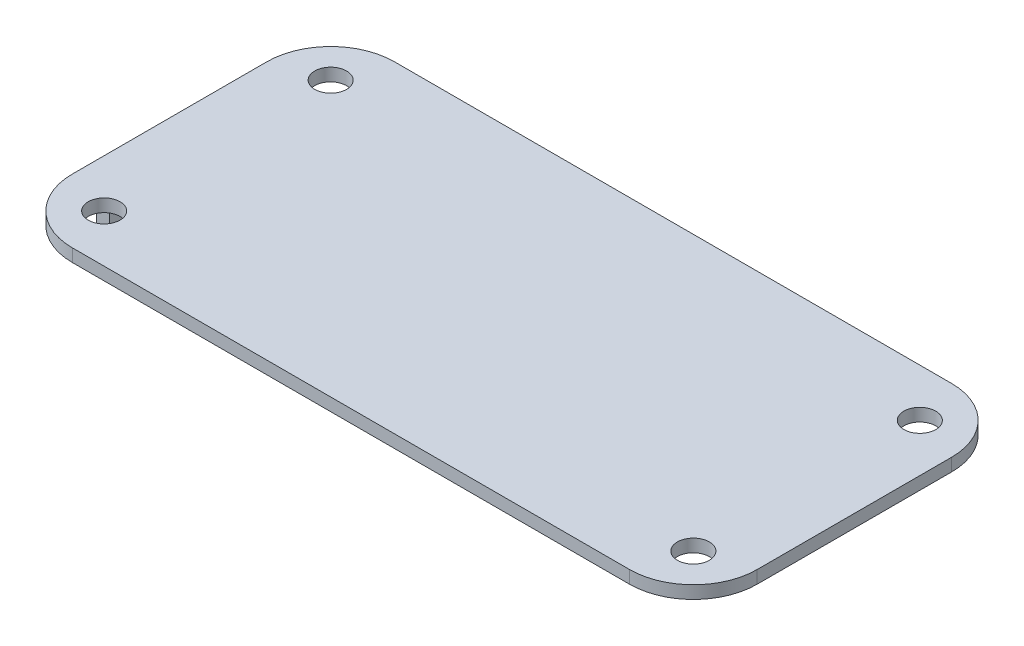
ISO-10303-21;
HEADER;
FILE_DESCRIPTION(('STEP AP214'),'2;1');
FILE_NAME('part.step','',(''),(''),'','','');
FILE_SCHEMA(('AUTOMOTIVE_DESIGN { 1 0 10303 214 1 1 1 1 }'));
ENDSEC;
DATA;
#1=APPLICATION_CONTEXT('core data for automotive mechanical design processes');
#2=APPLICATION_PROTOCOL_DEFINITION('international standard','automotive_design',2000,#1);
#3=PRODUCT_CONTEXT('',#1,'mechanical');
#4=PRODUCT('Part','Part','',(#3));
#5=PRODUCT_RELATED_PRODUCT_CATEGORY('part','',(#4));
#6=PRODUCT_DEFINITION_FORMATION('','',#4);
#7=PRODUCT_DEFINITION_CONTEXT('part definition',#1,'design');
#8=PRODUCT_DEFINITION('design','',#6,#7);
#9=PRODUCT_DEFINITION_SHAPE('','',#8);
#10=(LENGTH_UNIT() NAMED_UNIT(*) SI_UNIT(.MILLI.,.METRE.));
#11=(NAMED_UNIT(*) PLANE_ANGLE_UNIT() SI_UNIT($,.RADIAN.));
#12=(NAMED_UNIT(*) SI_UNIT($,.STERADIAN.) SOLID_ANGLE_UNIT());
#13=UNCERTAINTY_MEASURE_WITH_UNIT(LENGTH_MEASURE(1.E-05),#10,'distance_accuracy_value','');
#14=(GEOMETRIC_REPRESENTATION_CONTEXT(3) GLOBAL_UNCERTAINTY_ASSIGNED_CONTEXT((#13)) GLOBAL_UNIT_ASSIGNED_CONTEXT((#10,
#11,#12)) REPRESENTATION_CONTEXT('',''));
#15=CARTESIAN_POINT('',(0.,0.,0.));
#16=DIRECTION('',(0.,0.,1.));
#17=DIRECTION('',(1.,0.,0.));
#18=AXIS2_PLACEMENT_3D('',#15,#16,#17);
#19=CARTESIAN_POINT('',(87.35,4.,30.5));
#20=DIRECTION('',(0.,1.,0.));
#21=DIRECTION('',(0.,0.,1.));
#22=AXIS2_PLACEMENT_3D('',#19,#20,#21);
#23=PLANE('',#22);
#24=DIRECTION('',(0.,0.,1.));
#25=VECTOR('',#24,1.);
#26=CARTESIAN_POINT('',(-107.35,4.,30.4999999999999));
#27=LINE('',#26,#25);
#28=CARTESIAN_POINT('',(-107.35,4.,-30.4999999999999));
#29=VERTEX_POINT('',#28);
#30=CARTESIAN_POINT('',(-107.35,4.,30.4999999999999));
#31=VERTEX_POINT('',#30);
#32=EDGE_CURVE('E192',#29,#31,#27,.T.);
#33=ORIENTED_EDGE('',*,*,#32,.T.);
#34=CARTESIAN_POINT('',(-87.35,4.,30.5));
#35=DIRECTION('',(0.,1.,0.));
#36=DIRECTION('',(0.,0.,-1.));
#37=AXIS2_PLACEMENT_3D('',#34,#35,#36);
#38=CIRCLE('',#37,20.);
#39=CARTESIAN_POINT('',(-87.3499999999999,4.,50.5));
#40=VERTEX_POINT('',#39);
#41=EDGE_CURVE('E194',#31,#40,#38,.T.);
#42=ORIENTED_EDGE('',*,*,#41,.T.);
#43=DIRECTION('',(1.,0.,0.));
#44=VECTOR('',#43,1.);
#45=CARTESIAN_POINT('',(-87.3499999999999,4.,50.5));
#46=LINE('',#45,#44);
#47=CARTESIAN_POINT('',(87.3499999999999,4.,50.5));
#48=VERTEX_POINT('',#47);
#49=EDGE_CURVE('E196',#40,#48,#46,.T.);
#50=ORIENTED_EDGE('',*,*,#49,.T.);
#51=CARTESIAN_POINT('',(87.35,4.,30.5));
#52=DIRECTION('',(0.,1.,0.));
#53=DIRECTION('',(0.,0.,1.));
#54=AXIS2_PLACEMENT_3D('',#51,#52,#53);
#55=CIRCLE('',#54,20.);
#56=CARTESIAN_POINT('',(107.35,4.,30.4999999999998));
#57=VERTEX_POINT('',#56);
#58=EDGE_CURVE('E180',#48,#57,#55,.T.);
#59=ORIENTED_EDGE('',*,*,#58,.T.);
#60=DIRECTION('',(0.,0.,-1.));
#61=VECTOR('',#60,1.);
#62=CARTESIAN_POINT('',(107.35,4.,30.4999999999998));
#63=LINE('',#62,#61);
#64=CARTESIAN_POINT('',(107.35,4.,-30.4999999999999));
#65=VERTEX_POINT('',#64);
#66=EDGE_CURVE('E183',#57,#65,#63,.T.);
#67=ORIENTED_EDGE('',*,*,#66,.T.);
#68=CARTESIAN_POINT('',(87.35,4.,-30.5));
#69=DIRECTION('',(0.,1.,0.));
#70=DIRECTION('',(0.,0.,-1.));
#71=AXIS2_PLACEMENT_3D('',#68,#69,#70);
#72=CIRCLE('',#71,20.);
#73=CARTESIAN_POINT('',(87.3499999999999,4.,-50.5));
#74=VERTEX_POINT('',#73);
#75=EDGE_CURVE('E186',#65,#74,#72,.T.);
#76=ORIENTED_EDGE('',*,*,#75,.T.);
#77=DIRECTION('',(-1.,0.,0.));
#78=VECTOR('',#77,1.);
#79=CARTESIAN_POINT('',(-87.3499999999999,4.,-50.5));
#80=LINE('',#79,#78);
#81=CARTESIAN_POINT('',(-87.35,4.,-50.5));
#82=VERTEX_POINT('',#81);
#83=EDGE_CURVE('E188',#74,#82,#80,.T.);
#84=ORIENTED_EDGE('',*,*,#83,.T.);
#85=CARTESIAN_POINT('',(-87.35,4.,-30.5));
#86=DIRECTION('',(0.,1.,0.));
#87=DIRECTION('',(0.,0.,-1.));
#88=AXIS2_PLACEMENT_3D('',#85,#86,#87);
#89=CIRCLE('',#88,20.);
#90=EDGE_CURVE('E190',#82,#29,#89,.T.);
#91=ORIENTED_EDGE('',*,*,#90,.T.);
#92=EDGE_LOOP('',(#33,#42,#50,#59,#67,#76,#84,#91));
#93=FACE_BOUND('',#92,.T.);
#94=CARTESIAN_POINT('',(92.3500000000008,4.,35.5));
#95=DIRECTION('',(0.,1.,0.));
#96=DIRECTION('',(0.,0.,1.));
#97=AXIS2_PLACEMENT_3D('',#94,#95,#96);
#98=CIRCLE('',#97,5.00000000000001);
#99=CARTESIAN_POINT('',(92.3500000000008,4.,40.5));
#100=VERTEX_POINT('',#99);
#101=EDGE_CURVE('E162',#100,#100,#98,.T.);
#102=ORIENTED_EDGE('',*,*,#101,.F.);
#103=EDGE_LOOP('',(#102));
#104=FACE_BOUND('',#103,.T.);
#105=CARTESIAN_POINT('',(-92.35,4.,-35.5));
#106=DIRECTION('',(0.,1.,0.));
#107=DIRECTION('',(0.,0.,1.));
#108=AXIS2_PLACEMENT_3D('',#105,#106,#107);
#109=CIRCLE('',#108,5.00000000000001);
#110=CARTESIAN_POINT('',(-92.35,4.,-30.5));
#111=VERTEX_POINT('',#110);
#112=EDGE_CURVE('E174',#111,#111,#109,.T.);
#113=ORIENTED_EDGE('',*,*,#112,.F.);
#114=EDGE_LOOP('',(#113));
#115=FACE_BOUND('',#114,.T.);
#116=CARTESIAN_POINT('',(92.35,4.,-35.5));
#117=DIRECTION('',(0.,1.,0.));
#118=DIRECTION('',(0.,0.,1.));
#119=AXIS2_PLACEMENT_3D('',#116,#117,#118);
#120=CIRCLE('',#119,5.00000000000001);
#121=CARTESIAN_POINT('',(92.35,4.,-30.5));
#122=VERTEX_POINT('',#121);
#123=EDGE_CURVE('E168',#122,#122,#120,.T.);
#124=ORIENTED_EDGE('',*,*,#123,.F.);
#125=EDGE_LOOP('',(#124));
#126=FACE_BOUND('',#125,.T.);
#127=CARTESIAN_POINT('',(-92.3499999999993,4.,35.5));
#128=DIRECTION('',(0.,1.,0.));
#129=DIRECTION('',(0.,0.,1.));
#130=AXIS2_PLACEMENT_3D('',#127,#128,#129);
#131=CIRCLE('',#130,5.00000000000001);
#132=CARTESIAN_POINT('',(-92.3499999999993,4.,40.5));
#133=VERTEX_POINT('',#132);
#134=EDGE_CURVE('E156',#133,#133,#131,.T.);
#135=ORIENTED_EDGE('',*,*,#134,.F.);
#136=EDGE_LOOP('',(#135));
#137=FACE_BOUND('',#136,.T.);
#138=ADVANCED_FACE('F33',(#93,#104,#115,#126,#137),#23,.T.);
#139=CARTESIAN_POINT('',(87.35,0.,30.5));
#140=DIRECTION('',(0.,1.,0.));
#141=DIRECTION('',(0.,0.,1.));
#142=AXIS2_PLACEMENT_3D('',#139,#140,#141);
#143=PLANE('',#142);
#144=DIRECTION('',(0.,0.,1.));
#145=VECTOR('',#144,1.);
#146=CARTESIAN_POINT('',(-107.35,0.,30.4999999999999));
#147=LINE('',#146,#145);
#148=CARTESIAN_POINT('',(-107.35,0.,22.85));
#149=VERTEX_POINT('',#148);
#150=CARTESIAN_POINT('',(-107.35,0.,30.4999999999999));
#151=VERTEX_POINT('',#150);
#152=EDGE_CURVE('E52',#149,#151,#147,.T.);
#153=ORIENTED_EDGE('',*,*,#152,.F.);
#154=DIRECTION('',(1.,0.,0.));
#155=VECTOR('',#154,1.);
#156=CARTESIAN_POINT('',(87.35,0.,22.85));
#157=LINE('',#156,#155);
#158=CARTESIAN_POINT('',(-103.35,0.,22.85));
#159=VERTEX_POINT('',#158);
#160=EDGE_CURVE('E48',#149,#159,#157,.T.);
#161=ORIENTED_EDGE('',*,*,#160,.T.);
#162=DIRECTION('',(0.,0.,1.));
#163=VECTOR('',#162,1.);
#164=CARTESIAN_POINT('',(-103.35,0.,30.5000000000001));
#165=LINE('',#164,#163);
#166=CARTESIAN_POINT('',(-103.35,0.,-22.85));
#167=VERTEX_POINT('',#166);
#168=EDGE_CURVE('E11',#167,#159,#165,.T.);
#169=ORIENTED_EDGE('',*,*,#168,.F.);
#170=DIRECTION('',(1.,0.,0.));
#171=VECTOR('',#170,1.);
#172=CARTESIAN_POINT('',(87.35,0.,-22.85));
#173=LINE('',#172,#171);
#174=CARTESIAN_POINT('',(-107.35,0.,-22.85));
#175=VERTEX_POINT('',#174);
#176=EDGE_CURVE('E135',#175,#167,#173,.T.);
#177=ORIENTED_EDGE('',*,*,#176,.F.);
#178=CARTESIAN_POINT('',(-107.35,0.,-30.4999999999999));
#179=VERTEX_POINT('',#178);
#180=EDGE_CURVE('E209',#179,#175,#147,.T.);
#181=ORIENTED_EDGE('',*,*,#180,.F.);
#182=CARTESIAN_POINT('',(-87.35,0.,-30.5));
#183=DIRECTION('',(0.,1.,0.));
#184=DIRECTION('',(0.,0.,-1.));
#185=AXIS2_PLACEMENT_3D('',#182,#183,#184);
#186=CIRCLE('',#185,20.);
#187=CARTESIAN_POINT('',(-87.35,0.,-50.5));
#188=VERTEX_POINT('',#187);
#189=EDGE_CURVE('E207',#188,#179,#186,.T.);
#190=ORIENTED_EDGE('',*,*,#189,.F.);
#191=DIRECTION('',(-1.,0.,0.));
#192=VECTOR('',#191,1.);
#193=CARTESIAN_POINT('',(-87.3499999999999,0.,-50.5));
#194=LINE('',#193,#192);
#195=CARTESIAN_POINT('',(87.3499999999999,0.,-50.5));
#196=VERTEX_POINT('',#195);
#197=EDGE_CURVE('E205',#196,#188,#194,.T.);
#198=ORIENTED_EDGE('',*,*,#197,.F.);
#199=CARTESIAN_POINT('',(87.35,0.,-30.5));
#200=DIRECTION('',(0.,1.,0.));
#201=DIRECTION('',(0.,0.,-1.));
#202=AXIS2_PLACEMENT_3D('',#199,#200,#201);
#203=CIRCLE('',#202,20.);
#204=CARTESIAN_POINT('',(107.35,0.,-30.4999999999999));
#205=VERTEX_POINT('',#204);
#206=EDGE_CURVE('E203',#205,#196,#203,.T.);
#207=ORIENTED_EDGE('',*,*,#206,.F.);
#208=DIRECTION('',(0.,0.,-1.));
#209=VECTOR('',#208,1.);
#210=CARTESIAN_POINT('',(107.35,0.,30.4999999999998));
#211=LINE('',#210,#209);
#212=CARTESIAN_POINT('',(107.35,0.,30.4999999999998));
#213=VERTEX_POINT('',#212);
#214=EDGE_CURVE('E201',#213,#205,#211,.T.);
#215=ORIENTED_EDGE('',*,*,#214,.F.);
#216=CARTESIAN_POINT('',(87.35,0.,30.5));
#217=DIRECTION('',(0.,1.,0.));
#218=DIRECTION('',(0.,0.,1.));
#219=AXIS2_PLACEMENT_3D('',#216,#217,#218);
#220=CIRCLE('',#219,20.);
#221=CARTESIAN_POINT('',(87.3499999999999,0.,50.5));
#222=VERTEX_POINT('',#221);
#223=EDGE_CURVE('E177',#222,#213,#220,.T.);
#224=ORIENTED_EDGE('',*,*,#223,.F.);
#225=DIRECTION('',(1.,0.,0.));
#226=VECTOR('',#225,1.);
#227=CARTESIAN_POINT('',(-87.3499999999999,0.,50.5));
#228=LINE('',#227,#226);
#229=CARTESIAN_POINT('',(-87.3499999999999,0.,50.5));
#230=VERTEX_POINT('',#229);
#231=EDGE_CURVE('E184',#230,#222,#228,.T.);
#232=ORIENTED_EDGE('',*,*,#231,.F.);
#233=CARTESIAN_POINT('',(-87.35,0.,30.5));
#234=DIRECTION('',(0.,1.,0.));
#235=DIRECTION('',(0.,0.,-1.));
#236=AXIS2_PLACEMENT_3D('',#233,#234,#235);
#237=CIRCLE('',#236,20.);
#238=EDGE_CURVE('E212',#151,#230,#237,.T.);
#239=ORIENTED_EDGE('',*,*,#238,.F.);
#240=EDGE_LOOP('',(#153,#161,#169,#177,#181,#190,#198,#207,#215,#224,#232,#239));
#241=FACE_BOUND('',#240,.T.);
#242=CARTESIAN_POINT('',(-92.35,0.,-35.5));
#243=DIRECTION('',(0.,1.,0.));
#244=DIRECTION('',(0.,0.,1.));
#245=AXIS2_PLACEMENT_3D('',#242,#243,#244);
#246=CIRCLE('',#245,5.00000000000001);
#247=CARTESIAN_POINT('',(-92.35,0.,-30.5));
#248=VERTEX_POINT('',#247);
#249=EDGE_CURVE('E171',#248,#248,#246,.T.);
#250=ORIENTED_EDGE('',*,*,#249,.T.);
#251=EDGE_LOOP('',(#250));
#252=FACE_BOUND('',#251,.T.);
#253=CARTESIAN_POINT('',(92.35,0.,-35.5));
#254=DIRECTION('',(0.,1.,0.));
#255=DIRECTION('',(0.,0.,1.));
#256=AXIS2_PLACEMENT_3D('',#253,#254,#255);
#257=CIRCLE('',#256,5.00000000000001);
#258=CARTESIAN_POINT('',(92.35,0.,-30.5));
#259=VERTEX_POINT('',#258);
#260=EDGE_CURVE('E165',#259,#259,#257,.T.);
#261=ORIENTED_EDGE('',*,*,#260,.T.);
#262=EDGE_LOOP('',(#261));
#263=FACE_BOUND('',#262,.T.);
#264=CARTESIAN_POINT('',(92.3500000000008,0.,35.5));
#265=DIRECTION('',(0.,1.,0.));
#266=DIRECTION('',(0.,0.,1.));
#267=AXIS2_PLACEMENT_3D('',#264,#265,#266);
#268=CIRCLE('',#267,5.00000000000001);
#269=CARTESIAN_POINT('',(92.3500000000008,0.,40.5));
#270=VERTEX_POINT('',#269);
#271=EDGE_CURVE('E159',#270,#270,#268,.T.);
#272=ORIENTED_EDGE('',*,*,#271,.T.);
#273=EDGE_LOOP('',(#272));
#274=FACE_BOUND('',#273,.T.);
#275=CARTESIAN_POINT('',(-92.3499999999993,0.,35.5));
#276=DIRECTION('',(0.,1.,0.));
#277=DIRECTION('',(0.,0.,1.));
#278=AXIS2_PLACEMENT_3D('',#275,#276,#277);
#279=CIRCLE('',#278,5.00000000000001);
#280=CARTESIAN_POINT('',(-92.3499999999993,0.,40.5));
#281=VERTEX_POINT('',#280);
#282=EDGE_CURVE('E155',#281,#281,#279,.T.);
#283=ORIENTED_EDGE('',*,*,#282,.T.);
#284=EDGE_LOOP('',(#283));
#285=FACE_BOUND('',#284,.T.);
#286=ADVANCED_FACE('F244',(#241,#252,#263,#274,#285),#143,.F.);
#287=CARTESIAN_POINT('',(87.35,4.,30.5));
#288=DIRECTION('',(0.,-1.,0.));
#289=DIRECTION('',(0.,0.,-1.));
#290=AXIS2_PLACEMENT_3D('',#287,#288,#289);
#291=CYLINDRICAL_SURFACE('',#290,20.);
#292=ORIENTED_EDGE('',*,*,#223,.T.);
#293=DIRECTION('',(0.,-1.,0.));
#294=VECTOR('',#293,1.);
#295=CARTESIAN_POINT('',(107.35,4.,30.4999999999998));
#296=LINE('',#295,#294);
#297=EDGE_CURVE('E41',#57,#213,#296,.T.);
#298=ORIENTED_EDGE('',*,*,#297,.F.);
#299=ORIENTED_EDGE('',*,*,#58,.F.);
#300=DIRECTION('',(0.,-1.,0.));
#301=VECTOR('',#300,1.);
#302=CARTESIAN_POINT('',(87.3499999999999,4.,50.5));
#303=LINE('',#302,#301);
#304=EDGE_CURVE('E198',#48,#222,#303,.T.);
#305=ORIENTED_EDGE('',*,*,#304,.T.);
#306=EDGE_LOOP('',(#292,#298,#299,#305));
#307=FACE_BOUND('',#306,.T.);
#308=ADVANCED_FACE('F35',(#307),#291,.T.);
#309=CARTESIAN_POINT('',(107.35,4.,30.4999999999998));
#310=DIRECTION('',(-1.,0.,0.));
#311=DIRECTION('',(0.,0.,1.));
#312=AXIS2_PLACEMENT_3D('',#309,#310,#311);
#313=PLANE('',#312);
#314=ORIENTED_EDGE('',*,*,#214,.T.);
#315=DIRECTION('',(0.,-1.,0.));
#316=VECTOR('',#315,1.);
#317=CARTESIAN_POINT('',(107.35,4.,-30.4999999999999));
#318=LINE('',#317,#316);
#319=EDGE_CURVE('E232',#65,#205,#318,.T.);
#320=ORIENTED_EDGE('',*,*,#319,.F.);
#321=ORIENTED_EDGE('',*,*,#66,.F.);
#322=ORIENTED_EDGE('',*,*,#297,.T.);
#323=EDGE_LOOP('',(#314,#320,#321,#322));
#324=FACE_BOUND('',#323,.T.);
#325=ADVANCED_FACE('F237',(#324),#313,.F.);
#326=CARTESIAN_POINT('',(87.35,4.,-30.5));
#327=DIRECTION('',(0.,-1.,0.));
#328=DIRECTION('',(0.,0.,-1.));
#329=AXIS2_PLACEMENT_3D('',#326,#327,#328);
#330=CYLINDRICAL_SURFACE('',#329,20.);
#331=ORIENTED_EDGE('',*,*,#206,.T.);
#332=DIRECTION('',(0.,-1.,0.));
#333=VECTOR('',#332,1.);
#334=CARTESIAN_POINT('',(87.3499999999999,4.,-50.5));
#335=LINE('',#334,#333);
#336=EDGE_CURVE('E229',#74,#196,#335,.T.);
#337=ORIENTED_EDGE('',*,*,#336,.F.);
#338=ORIENTED_EDGE('',*,*,#75,.F.);
#339=ORIENTED_EDGE('',*,*,#319,.T.);
#340=EDGE_LOOP('',(#331,#337,#338,#339));
#341=FACE_BOUND('',#340,.T.);
#342=ADVANCED_FACE('F251',(#341),#330,.T.);
#343=CARTESIAN_POINT('',(-87.3499999999999,4.,-50.5));
#344=DIRECTION('',(0.,0.,1.));
#345=DIRECTION('',(1.,0.,0.));
#346=AXIS2_PLACEMENT_3D('',#343,#344,#345);
#347=PLANE('',#346);
#348=ORIENTED_EDGE('',*,*,#197,.T.);
#349=DIRECTION('',(0.,-1.,0.));
#350=VECTOR('',#349,1.);
#351=CARTESIAN_POINT('',(-87.35,4.,-50.5));
#352=LINE('',#351,#350);
#353=EDGE_CURVE('E226',#82,#188,#352,.T.);
#354=ORIENTED_EDGE('',*,*,#353,.F.);
#355=ORIENTED_EDGE('',*,*,#83,.F.);
#356=ORIENTED_EDGE('',*,*,#336,.T.);
#357=EDGE_LOOP('',(#348,#354,#355,#356));
#358=FACE_BOUND('',#357,.T.);
#359=ADVANCED_FACE('F255',(#358),#347,.F.);
#360=CARTESIAN_POINT('',(-87.35,4.,-30.5));
#361=DIRECTION('',(0.,-1.,0.));
#362=DIRECTION('',(0.,0.,-1.));
#363=AXIS2_PLACEMENT_3D('',#360,#361,#362);
#364=CYLINDRICAL_SURFACE('',#363,20.);
#365=ORIENTED_EDGE('',*,*,#189,.T.);
#366=DIRECTION('',(0.,-1.,0.));
#367=VECTOR('',#366,1.);
#368=CARTESIAN_POINT('',(-107.35,4.,-30.4999999999999));
#369=LINE('',#368,#367);
#370=EDGE_CURVE('E223',#29,#179,#369,.T.);
#371=ORIENTED_EDGE('',*,*,#370,.F.);
#372=ORIENTED_EDGE('',*,*,#90,.F.);
#373=ORIENTED_EDGE('',*,*,#353,.T.);
#374=EDGE_LOOP('',(#365,#371,#372,#373));
#375=FACE_BOUND('',#374,.T.);
#376=ADVANCED_FACE('F300',(#375),#364,.T.);
#377=CARTESIAN_POINT('',(-107.35,4.,30.4999999999999));
#378=DIRECTION('',(1.,0.,0.));
#379=DIRECTION('',(0.,0.,-1.));
#380=AXIS2_PLACEMENT_3D('',#377,#378,#379);
#381=PLANE('',#380);
#382=DIRECTION('',(0.,-1.,0.));
#383=VECTOR('',#382,1.);
#384=CARTESIAN_POINT('',(-107.35,4.,30.4999999999999));
#385=LINE('',#384,#383);
#386=EDGE_CURVE('E220',#31,#151,#385,.T.);
#387=ORIENTED_EDGE('',*,*,#386,.F.);
#388=ORIENTED_EDGE('',*,*,#32,.F.);
#389=ORIENTED_EDGE('',*,*,#370,.T.);
#390=ORIENTED_EDGE('',*,*,#180,.T.);
#391=DIRECTION('',(0.,1.,0.));
#392=VECTOR('',#391,1.);
#393=CARTESIAN_POINT('',(-107.35,-17.3,-22.85));
#394=LINE('',#393,#392);
#395=CARTESIAN_POINT('',(-107.35,-17.3,-22.85));
#396=VERTEX_POINT('',#395);
#397=EDGE_CURVE('E137',#396,#175,#394,.T.);
#398=ORIENTED_EDGE('',*,*,#397,.F.);
#399=DIRECTION('',(0.,0.,1.));
#400=VECTOR('',#399,1.);
#401=CARTESIAN_POINT('',(-107.35,-17.3,0.));
#402=LINE('',#401,#400);
#403=CARTESIAN_POINT('',(-107.35,-17.3,22.85));
#404=VERTEX_POINT('',#403);
#405=EDGE_CURVE('E127',#396,#404,#402,.T.);
#406=ORIENTED_EDGE('',*,*,#405,.T.);
#407=DIRECTION('',(0.,1.,0.));
#408=VECTOR('',#407,1.);
#409=CARTESIAN_POINT('',(-107.35,-17.3,22.85));
#410=LINE('',#409,#408);
#411=EDGE_CURVE('E149',#404,#149,#410,.T.);
#412=ORIENTED_EDGE('',*,*,#411,.T.);
#413=ORIENTED_EDGE('',*,*,#152,.T.);
#414=EDGE_LOOP('',(#387,#388,#389,#390,#398,#406,#412,#413));
#415=FACE_BOUND('',#414,.T.);
#416=ADVANCED_FACE('F271',(#415),#381,.F.);
#417=CARTESIAN_POINT('',(-87.35,4.,30.5));
#418=DIRECTION('',(0.,-1.,0.));
#419=DIRECTION('',(0.,0.,-1.));
#420=AXIS2_PLACEMENT_3D('',#417,#418,#419);
#421=CYLINDRICAL_SURFACE('',#420,20.);
#422=ORIENTED_EDGE('',*,*,#238,.T.);
#423=DIRECTION('',(0.,-1.,0.));
#424=VECTOR('',#423,1.);
#425=CARTESIAN_POINT('',(-87.3499999999999,4.,50.5));
#426=LINE('',#425,#424);
#427=EDGE_CURVE('E217',#40,#230,#426,.T.);
#428=ORIENTED_EDGE('',*,*,#427,.F.);
#429=ORIENTED_EDGE('',*,*,#41,.F.);
#430=ORIENTED_EDGE('',*,*,#386,.T.);
#431=EDGE_LOOP('',(#422,#428,#429,#430));
#432=FACE_BOUND('',#431,.T.);
#433=ADVANCED_FACE('F267',(#432),#421,.T.);
#434=CARTESIAN_POINT('',(-87.3499999999999,4.,50.5));
#435=DIRECTION('',(0.,0.,-1.));
#436=DIRECTION('',(-1.,0.,0.));
#437=AXIS2_PLACEMENT_3D('',#434,#435,#436);
#438=PLANE('',#437);
#439=ORIENTED_EDGE('',*,*,#231,.T.);
#440=ORIENTED_EDGE('',*,*,#304,.F.);
#441=ORIENTED_EDGE('',*,*,#49,.F.);
#442=ORIENTED_EDGE('',*,*,#427,.T.);
#443=EDGE_LOOP('',(#439,#440,#441,#442));
#444=FACE_BOUND('',#443,.T.);
#445=ADVANCED_FACE('F265',(#444),#438,.F.);
#446=CARTESIAN_POINT('',(-92.35,4.,-35.5));
#447=DIRECTION('',(0.,-1.,0.));
#448=DIRECTION('',(0.,0.,-1.));
#449=AXIS2_PLACEMENT_3D('',#446,#447,#448);
#450=CYLINDRICAL_SURFACE('',#449,5.00000000000001);
#451=ORIENTED_EDGE('',*,*,#112,.T.);
#452=EDGE_LOOP('',(#451));
#453=FACE_BOUND('',#452,.T.);
#454=ORIENTED_EDGE('',*,*,#249,.F.);
#455=EDGE_LOOP('',(#454));
#456=FACE_BOUND('',#455,.T.);
#457=ADVANCED_FACE('F291',(#453,#456),#450,.F.);
#458=CARTESIAN_POINT('',(92.35,4.,-35.5));
#459=DIRECTION('',(0.,-1.,0.));
#460=DIRECTION('',(0.,0.,-1.));
#461=AXIS2_PLACEMENT_3D('',#458,#459,#460);
#462=CYLINDRICAL_SURFACE('',#461,5.00000000000001);
#463=ORIENTED_EDGE('',*,*,#123,.T.);
#464=EDGE_LOOP('',(#463));
#465=FACE_BOUND('',#464,.T.);
#466=ORIENTED_EDGE('',*,*,#260,.F.);
#467=EDGE_LOOP('',(#466));
#468=FACE_BOUND('',#467,.T.);
#469=ADVANCED_FACE('F365',(#465,#468),#462,.F.);
#470=CARTESIAN_POINT('',(92.3500000000008,4.,35.5));
#471=DIRECTION('',(0.,-1.,0.));
#472=DIRECTION('',(0.,0.,-1.));
#473=AXIS2_PLACEMENT_3D('',#470,#471,#472);
#474=CYLINDRICAL_SURFACE('',#473,5.00000000000001);
#475=ORIENTED_EDGE('',*,*,#101,.T.);
#476=EDGE_LOOP('',(#475));
#477=FACE_BOUND('',#476,.T.);
#478=ORIENTED_EDGE('',*,*,#271,.F.);
#479=EDGE_LOOP('',(#478));
#480=FACE_BOUND('',#479,.T.);
#481=ADVANCED_FACE('F357',(#477,#480),#474,.F.);
#482=CARTESIAN_POINT('',(-92.3499999999993,4.,35.5));
#483=DIRECTION('',(0.,-1.,0.));
#484=DIRECTION('',(0.,0.,-1.));
#485=AXIS2_PLACEMENT_3D('',#482,#483,#484);
#486=CYLINDRICAL_SURFACE('',#485,5.00000000000001);
#487=ORIENTED_EDGE('',*,*,#134,.T.);
#488=EDGE_LOOP('',(#487));
#489=FACE_BOUND('',#488,.T.);
#490=ORIENTED_EDGE('',*,*,#282,.F.);
#491=EDGE_LOOP('',(#490));
#492=FACE_BOUND('',#491,.T.);
#493=ADVANCED_FACE('F281',(#489,#492),#486,.F.);
#494=CARTESIAN_POINT('',(-103.35,-17.3,0.));
#495=DIRECTION('',(-1.,0.,0.));
#496=DIRECTION('',(0.,0.,1.));
#497=AXIS2_PLACEMENT_3D('',#494,#495,#496);
#498=PLANE('',#497);
#499=DIRECTION('',(0.,1.,0.));
#500=VECTOR('',#499,1.);
#501=CARTESIAN_POINT('',(-103.35,-17.3,-22.85));
#502=LINE('',#501,#500);
#503=CARTESIAN_POINT('',(-103.35,-17.3,-22.85));
#504=VERTEX_POINT('',#503);
#505=EDGE_CURVE('E133',#504,#167,#502,.T.);
#506=ORIENTED_EDGE('',*,*,#505,.T.);
#507=ORIENTED_EDGE('',*,*,#168,.T.);
#508=DIRECTION('',(0.,1.,0.));
#509=VECTOR('',#508,1.);
#510=CARTESIAN_POINT('',(-103.35,-17.3,22.85));
#511=LINE('',#510,#509);
#512=CARTESIAN_POINT('',(-103.35,-17.3,22.85));
#513=VERTEX_POINT('',#512);
#514=EDGE_CURVE('E142',#513,#159,#511,.T.);
#515=ORIENTED_EDGE('',*,*,#514,.F.);
#516=DIRECTION('',(0.,0.,1.));
#517=VECTOR('',#516,1.);
#518=CARTESIAN_POINT('',(-103.35,-17.3,0.));
#519=LINE('',#518,#517);
#520=EDGE_CURVE('E124',#504,#513,#519,.T.);
#521=ORIENTED_EDGE('',*,*,#520,.F.);
#522=EDGE_LOOP('',(#506,#507,#515,#521));
#523=FACE_BOUND('',#522,.T.);
#524=ADVANCED_FACE('F140',(#523),#498,.F.);
#525=CARTESIAN_POINT('',(0.,-17.3,22.85));
#526=DIRECTION('',(0.,0.,1.));
#527=DIRECTION('',(1.,0.,0.));
#528=AXIS2_PLACEMENT_3D('',#525,#526,#527);
#529=PLANE('',#528);
#530=ORIENTED_EDGE('',*,*,#160,.F.);
#531=ORIENTED_EDGE('',*,*,#411,.F.);
#532=DIRECTION('',(1.,0.,0.));
#533=VECTOR('',#532,1.);
#534=CARTESIAN_POINT('',(0.,-17.3,22.85));
#535=LINE('',#534,#533);
#536=EDGE_CURVE('E138',#404,#513,#535,.T.);
#537=ORIENTED_EDGE('',*,*,#536,.T.);
#538=ORIENTED_EDGE('',*,*,#514,.T.);
#539=EDGE_LOOP('',(#530,#531,#537,#538));
#540=FACE_BOUND('',#539,.T.);
#541=ADVANCED_FACE('F273',(#540),#529,.T.);
#542=CARTESIAN_POINT('',(0.,-17.3,-22.85));
#543=DIRECTION('',(0.,0.,1.));
#544=DIRECTION('',(1.,0.,0.));
#545=AXIS2_PLACEMENT_3D('',#542,#543,#544);
#546=PLANE('',#545);
#547=ORIENTED_EDGE('',*,*,#397,.T.);
#548=ORIENTED_EDGE('',*,*,#176,.T.);
#549=ORIENTED_EDGE('',*,*,#505,.F.);
#550=DIRECTION('',(1.,0.,0.));
#551=VECTOR('',#550,1.);
#552=CARTESIAN_POINT('',(0.,-17.3,-22.85));
#553=LINE('',#552,#551);
#554=EDGE_CURVE('E119',#396,#504,#553,.T.);
#555=ORIENTED_EDGE('',*,*,#554,.F.);
#556=EDGE_LOOP('',(#547,#548,#549,#555));
#557=FACE_BOUND('',#556,.T.);
#558=ADVANCED_FACE('F134',(#557),#546,.F.);
#559=CARTESIAN_POINT('',(0.,-17.3,0.));
#560=DIRECTION('',(0.,1.,0.));
#561=DIRECTION('',(0.,0.,1.));
#562=AXIS2_PLACEMENT_3D('',#559,#560,#561);
#563=PLANE('',#562);
#564=ORIENTED_EDGE('',*,*,#520,.T.);
#565=ORIENTED_EDGE('',*,*,#536,.F.);
#566=ORIENTED_EDGE('',*,*,#405,.F.);
#567=ORIENTED_EDGE('',*,*,#554,.T.);
#568=EDGE_LOOP('',(#564,#565,#566,#567));
#569=FACE_BOUND('',#568,.T.);
#570=ADVANCED_FACE('F121',(#569),#563,.F.);
#571=CLOSED_SHELL('',(#138,#286,#308,#325,#342,#359,#376,#416,#433,#445,#457,#469,#481,#493,
#524,#541,#558,#570));
#572=MANIFOLD_SOLID_BREP('B2',#571);
#573=ADVANCED_BREP_SHAPE_REPRESENTATION('',(#18,#572),#14);
#574=SHAPE_DEFINITION_REPRESENTATION(#9,#573);
ENDSEC;
END-ISO-10303-21;
